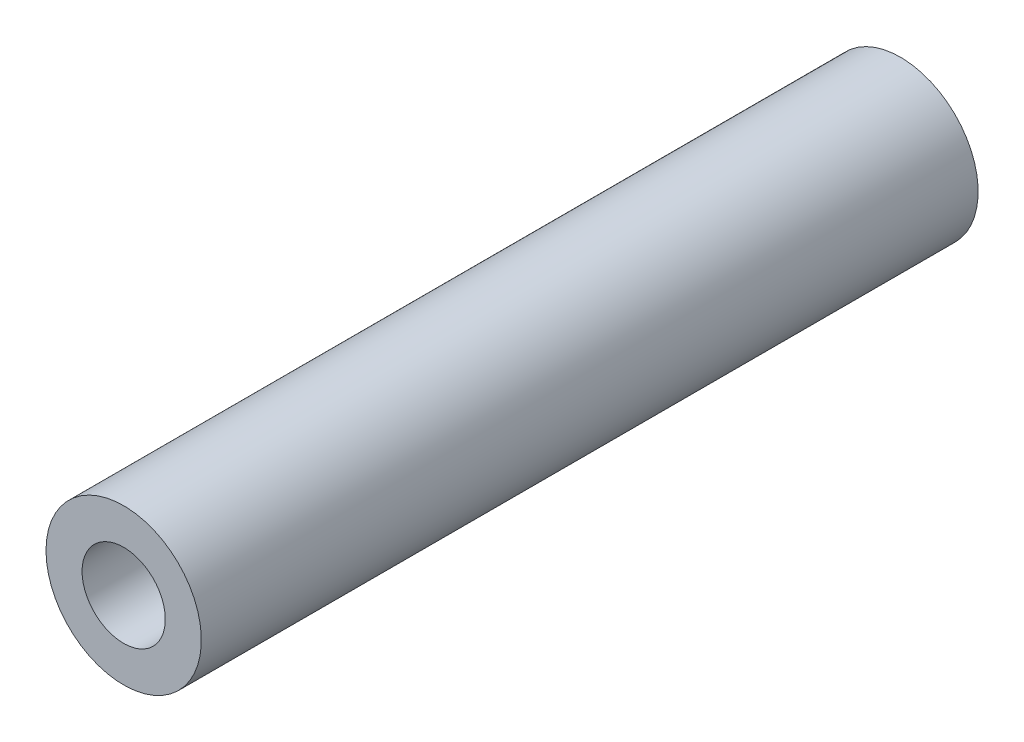
ISO-10303-21;
HEADER;
FILE_DESCRIPTION(('STEP AP214'),'2;1');
FILE_NAME('part.step','',(''),(''),'','','');
FILE_SCHEMA(('AUTOMOTIVE_DESIGN { 1 0 10303 214 1 1 1 1 }'));
ENDSEC;
DATA;
#1=APPLICATION_CONTEXT('core data for automotive mechanical design processes');
#2=APPLICATION_PROTOCOL_DEFINITION('international standard','automotive_design',2000,#1);
#3=PRODUCT_CONTEXT('',#1,'mechanical');
#4=PRODUCT('Part','Part','',(#3));
#5=PRODUCT_RELATED_PRODUCT_CATEGORY('part','',(#4));
#6=PRODUCT_DEFINITION_FORMATION('','',#4);
#7=PRODUCT_DEFINITION_CONTEXT('part definition',#1,'design');
#8=PRODUCT_DEFINITION('design','',#6,#7);
#9=PRODUCT_DEFINITION_SHAPE('','',#8);
#10=(LENGTH_UNIT() NAMED_UNIT(*) SI_UNIT(.MILLI.,.METRE.));
#11=(NAMED_UNIT(*) PLANE_ANGLE_UNIT() SI_UNIT($,.RADIAN.));
#12=(NAMED_UNIT(*) SI_UNIT($,.STERADIAN.) SOLID_ANGLE_UNIT());
#13=UNCERTAINTY_MEASURE_WITH_UNIT(LENGTH_MEASURE(1.E-05),#10,'distance_accuracy_value','');
#14=(GEOMETRIC_REPRESENTATION_CONTEXT(3) GLOBAL_UNCERTAINTY_ASSIGNED_CONTEXT((#13)) GLOBAL_UNIT_ASSIGNED_CONTEXT((#10,
#11,#12)) REPRESENTATION_CONTEXT('',''));
#15=CARTESIAN_POINT('',(0.,0.,0.));
#16=DIRECTION('',(0.,0.,1.));
#17=DIRECTION('',(1.,0.,0.));
#18=AXIS2_PLACEMENT_3D('',#15,#16,#17);
#19=CARTESIAN_POINT('',(0.,0.,23.8125));
#20=DIRECTION('',(0.,0.,-1.));
#21=DIRECTION('',(-1.,0.,0.));
#22=AXIS2_PLACEMENT_3D('',#19,#20,#21);
#23=CYLINDRICAL_SURFACE('',#22,2.5527);
#24=CARTESIAN_POINT('',(0.,0.,-23.8125));
#25=DIRECTION('',(0.,0.,-1.));
#26=DIRECTION('',(-1.,0.,0.));
#27=AXIS2_PLACEMENT_3D('',#24,#25,#26);
#28=CIRCLE('',#27,2.5527);
#29=CARTESIAN_POINT('',(-2.5527,0.,-23.8125));
#30=VERTEX_POINT('',#29);
#31=EDGE_CURVE('E26',#30,#30,#28,.T.);
#32=ORIENTED_EDGE('',*,*,#31,.T.);
#33=EDGE_LOOP('',(#32));
#34=FACE_BOUND('',#33,.T.);
#35=CARTESIAN_POINT('',(0.,0.,23.8125));
#36=DIRECTION('',(0.,0.,-1.));
#37=DIRECTION('',(-1.,0.,0.));
#38=AXIS2_PLACEMENT_3D('',#35,#36,#37);
#39=CIRCLE('',#38,2.5527);
#40=CARTESIAN_POINT('',(-2.5527,0.,23.8125));
#41=VERTEX_POINT('',#40);
#42=EDGE_CURVE('E17',#41,#41,#39,.T.);
#43=ORIENTED_EDGE('',*,*,#42,.F.);
#44=EDGE_LOOP('',(#43));
#45=FACE_BOUND('',#44,.T.);
#46=ADVANCED_FACE('F14',(#34,#45),#23,.F.);
#47=CARTESIAN_POINT('',(0.,0.,23.8125));
#48=DIRECTION('',(0.,0.,1.));
#49=DIRECTION('',(1.,0.,0.));
#50=AXIS2_PLACEMENT_3D('',#47,#48,#49);
#51=PLANE('',#50);
#52=ORIENTED_EDGE('',*,*,#42,.T.);
#53=EDGE_LOOP('',(#52));
#54=FACE_BOUND('',#53,.T.);
#55=CARTESIAN_POINT('',(0.,0.,23.8125));
#56=DIRECTION('',(0.,0.,-1.));
#57=DIRECTION('',(-1.,0.,0.));
#58=AXIS2_PLACEMENT_3D('',#55,#56,#57);
#59=CIRCLE('',#58,4.7625);
#60=CARTESIAN_POINT('',(-4.7625,0.,23.8125));
#61=VERTEX_POINT('',#60);
#62=EDGE_CURVE('E21',#61,#61,#59,.T.);
#63=ORIENTED_EDGE('',*,*,#62,.F.);
#64=EDGE_LOOP('',(#63));
#65=FACE_BOUND('',#64,.T.);
#66=ADVANCED_FACE('F34',(#54,#65),#51,.T.);
#67=CARTESIAN_POINT('',(0.,0.,-23.8125));
#68=DIRECTION('',(0.,0.,1.));
#69=DIRECTION('',(1.,0.,0.));
#70=AXIS2_PLACEMENT_3D('',#67,#68,#69);
#71=PLANE('',#70);
#72=ORIENTED_EDGE('',*,*,#31,.F.);
#73=EDGE_LOOP('',(#72));
#74=FACE_BOUND('',#73,.T.);
#75=CARTESIAN_POINT('',(0.,0.,-23.8125));
#76=DIRECTION('',(0.,0.,-1.));
#77=DIRECTION('',(-1.,0.,0.));
#78=AXIS2_PLACEMENT_3D('',#75,#76,#77);
#79=CIRCLE('',#78,4.7625);
#80=CARTESIAN_POINT('',(-4.7625,0.,-23.8125));
#81=VERTEX_POINT('',#80);
#82=EDGE_CURVE('E10',#81,#81,#79,.F.);
#83=ORIENTED_EDGE('',*,*,#82,.F.);
#84=EDGE_LOOP('',(#83));
#85=FACE_BOUND('',#84,.T.);
#86=ADVANCED_FACE('F42',(#74,#85),#71,.F.);
#87=CARTESIAN_POINT('',(0.,0.,23.8125));
#88=DIRECTION('',(0.,0.,-1.));
#89=DIRECTION('',(-1.,0.,0.));
#90=AXIS2_PLACEMENT_3D('',#87,#88,#89);
#91=CYLINDRICAL_SURFACE('',#90,4.7625);
#92=ORIENTED_EDGE('',*,*,#82,.T.);
#93=EDGE_LOOP('',(#92));
#94=FACE_BOUND('',#93,.T.);
#95=ORIENTED_EDGE('',*,*,#62,.T.);
#96=EDGE_LOOP('',(#95));
#97=FACE_BOUND('',#96,.T.);
#98=ADVANCED_FACE('F43',(#94,#97),#91,.T.);
#99=CLOSED_SHELL('',(#46,#66,#86,#98));
#100=MANIFOLD_SOLID_BREP('B1',#99);
#101=ADVANCED_BREP_SHAPE_REPRESENTATION('',(#18,#100),#14);
#102=SHAPE_DEFINITION_REPRESENTATION(#9,#101);
ENDSEC;
END-ISO-10303-21;
